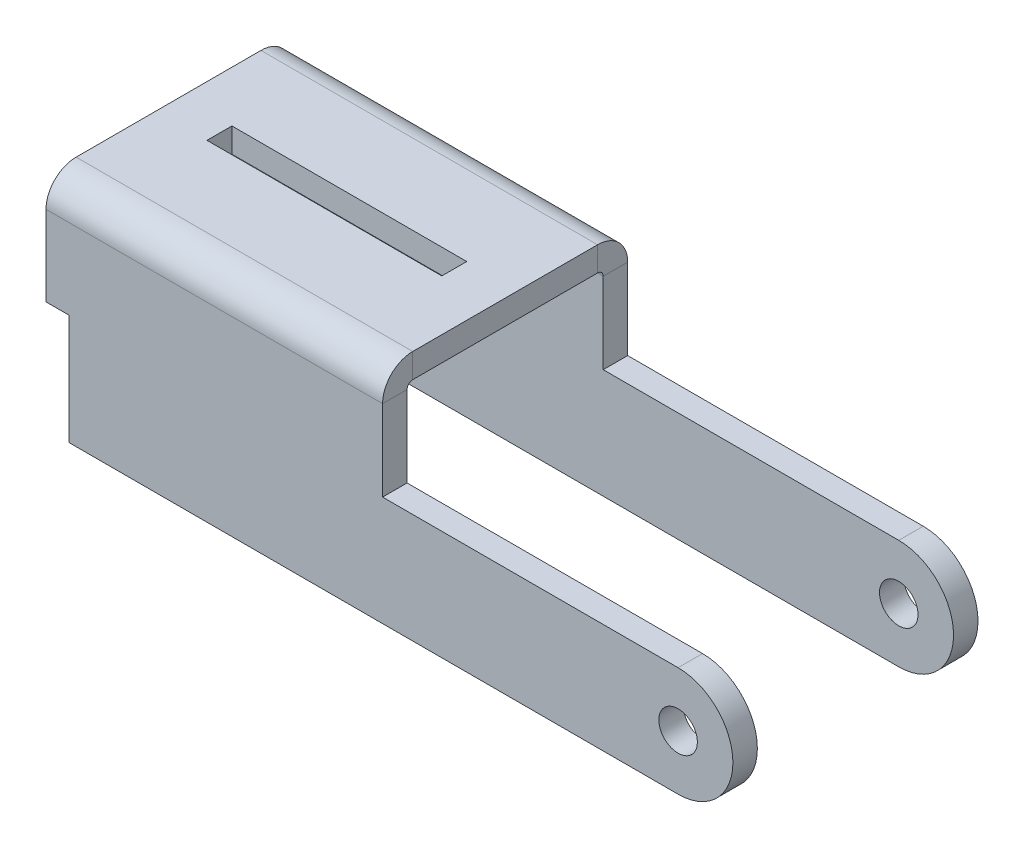
ISO-10303-21;
HEADER;
FILE_DESCRIPTION(('STEP AP214'),'2;1');
FILE_NAME('part.step','',(''),(''),'','','');
FILE_SCHEMA(('AUTOMOTIVE_DESIGN { 1 0 10303 214 1 1 1 1 }'));
ENDSEC;
DATA;
#1=APPLICATION_CONTEXT('core data for automotive mechanical design processes');
#2=APPLICATION_PROTOCOL_DEFINITION('international standard','automotive_design',2000,#1);
#3=PRODUCT_CONTEXT('',#1,'mechanical');
#4=PRODUCT('Part','Part','',(#3));
#5=PRODUCT_RELATED_PRODUCT_CATEGORY('part','',(#4));
#6=PRODUCT_DEFINITION_FORMATION('','',#4);
#7=PRODUCT_DEFINITION_CONTEXT('part definition',#1,'design');
#8=PRODUCT_DEFINITION('design','',#6,#7);
#9=PRODUCT_DEFINITION_SHAPE('','',#8);
#10=(LENGTH_UNIT() NAMED_UNIT(*) SI_UNIT(.MILLI.,.METRE.));
#11=(NAMED_UNIT(*) PLANE_ANGLE_UNIT() SI_UNIT($,.RADIAN.));
#12=(NAMED_UNIT(*) SI_UNIT($,.STERADIAN.) SOLID_ANGLE_UNIT());
#13=UNCERTAINTY_MEASURE_WITH_UNIT(LENGTH_MEASURE(1.E-05),#10,'distance_accuracy_value','');
#14=(GEOMETRIC_REPRESENTATION_CONTEXT(3) GLOBAL_UNCERTAINTY_ASSIGNED_CONTEXT((#13)) GLOBAL_UNIT_ASSIGNED_CONTEXT((#10,
#11,#12)) REPRESENTATION_CONTEXT('',''));
#15=CARTESIAN_POINT('',(0.,0.,0.));
#16=DIRECTION('',(0.,0.,1.));
#17=DIRECTION('',(1.,0.,0.));
#18=AXIS2_PLACEMENT_3D('',#15,#16,#17);
#19=CARTESIAN_POINT('',(82.042,7.112,-3.175));
#20=DIRECTION('',(0.,0.,1.));
#21=DIRECTION('',(1.,0.,0.));
#22=AXIS2_PLACEMENT_3D('',#19,#20,#21);
#23=CYLINDRICAL_SURFACE('',#22,2.49999999999999);
#24=CARTESIAN_POINT('',(82.042,7.112,0.));
#25=DIRECTION('',(0.,0.,-1.));
#26=DIRECTION('',(-1.,0.,0.));
#27=AXIS2_PLACEMENT_3D('',#24,#25,#26);
#28=CIRCLE('',#27,2.49999999999999);
#29=CARTESIAN_POINT('',(79.5420000000001,7.112,0.));
#30=VERTEX_POINT('',#29);
#31=EDGE_CURVE('E306',#30,#30,#28,.F.);
#32=ORIENTED_EDGE('',*,*,#31,.T.);
#33=EDGE_LOOP('',(#32));
#34=FACE_BOUND('',#33,.T.);
#35=CARTESIAN_POINT('',(82.042,7.112,-3.175));
#36=DIRECTION('',(0.,0.,1.));
#37=DIRECTION('',(1.,0.,0.));
#38=AXIS2_PLACEMENT_3D('',#35,#36,#37);
#39=CIRCLE('',#38,2.49999999999999);
#40=CARTESIAN_POINT('',(84.542,7.112,-3.175));
#41=VERTEX_POINT('',#40);
#42=EDGE_CURVE('E430',#41,#41,#39,.T.);
#43=ORIENTED_EDGE('',*,*,#42,.F.);
#44=EDGE_LOOP('',(#43));
#45=FACE_BOUND('',#44,.T.);
#46=ADVANCED_FACE('F47',(#34,#45),#23,.F.);
#47=CARTESIAN_POINT('',(3.,0.,181.863437594031));
#48=DIRECTION('',(1.,0.,0.));
#49=DIRECTION('',(0.,-1.,0.));
#50=AXIS2_PLACEMENT_3D('',#47,#48,#49);
#51=PLANE('',#50);
#52=DIRECTION('',(0.,0.,-1.));
#53=VECTOR('',#52,1.);
#54=CARTESIAN_POINT('',(3.,14.32,181.863437594031));
#55=LINE('',#54,#53);
#56=CARTESIAN_POINT('',(3.,14.32,0.));
#57=VERTEX_POINT('',#56);
#58=CARTESIAN_POINT('',(3.,14.32,-3.17500000000001));
#59=VERTEX_POINT('',#58);
#60=EDGE_CURVE('E304',#57,#59,#55,.T.);
#61=ORIENTED_EDGE('',*,*,#60,.T.);
#62=DIRECTION('',(0.,1.,0.));
#63=VECTOR('',#62,1.);
#64=CARTESIAN_POINT('',(3.,0.,-3.175));
#65=LINE('',#64,#63);
#66=CARTESIAN_POINT('',(3.,0.,-3.17500000000001));
#67=VERTEX_POINT('',#66);
#68=EDGE_CURVE('E111',#67,#59,#65,.T.);
#69=ORIENTED_EDGE('',*,*,#68,.F.);
#70=DIRECTION('',(0.,0.,-1.));
#71=VECTOR('',#70,1.);
#72=CARTESIAN_POINT('',(3.,0.,181.863437594031));
#73=LINE('',#72,#71);
#74=CARTESIAN_POINT('',(3.,0.,0.));
#75=VERTEX_POINT('',#74);
#76=EDGE_CURVE('E298',#75,#67,#73,.T.);
#77=ORIENTED_EDGE('',*,*,#76,.F.);
#78=DIRECTION('',(0.,-1.,0.));
#79=VECTOR('',#78,1.);
#80=CARTESIAN_POINT('',(3.,0.,0.));
#81=LINE('',#80,#79);
#82=EDGE_CURVE('E106',#57,#75,#81,.T.);
#83=ORIENTED_EDGE('',*,*,#82,.F.);
#84=EDGE_LOOP('',(#61,#69,#77,#83));
#85=FACE_BOUND('',#84,.T.);
#86=ADVANCED_FACE('F450',(#85),#51,.F.);
#87=CARTESIAN_POINT('',(43.688,0.,181.863437594031));
#88=DIRECTION('',(0.,-1.,0.));
#89=DIRECTION('',(0.,0.,-1.));
#90=AXIS2_PLACEMENT_3D('',#87,#88,#89);
#91=PLANE('',#90);
#92=DIRECTION('',(-1.,0.,0.));
#93=VECTOR('',#92,1.);
#94=CARTESIAN_POINT('',(43.688,0.,-3.175));
#95=LINE('',#94,#93);
#96=CARTESIAN_POINT('',(82.042,0.,-3.17500000000001));
#97=VERTEX_POINT('',#96);
#98=EDGE_CURVE('E248',#97,#67,#95,.T.);
#99=ORIENTED_EDGE('',*,*,#98,.F.);
#100=DIRECTION('',(0.,0.,-1.));
#101=VECTOR('',#100,1.);
#102=CARTESIAN_POINT('',(82.042,0.,181.863437594031));
#103=LINE('',#102,#101);
#104=CARTESIAN_POINT('',(82.042,0.,0.));
#105=VERTEX_POINT('',#104);
#106=EDGE_CURVE('E294',#105,#97,#103,.T.);
#107=ORIENTED_EDGE('',*,*,#106,.F.);
#108=DIRECTION('',(-1.,0.,0.));
#109=VECTOR('',#108,1.);
#110=CARTESIAN_POINT('',(43.688,0.,0.));
#111=LINE('',#110,#109);
#112=EDGE_CURVE('E301',#105,#75,#111,.T.);
#113=ORIENTED_EDGE('',*,*,#112,.T.);
#114=ORIENTED_EDGE('',*,*,#76,.T.);
#115=EDGE_LOOP('',(#99,#107,#113,#114));
#116=FACE_BOUND('',#115,.T.);
#117=ADVANCED_FACE('F443',(#116),#91,.T.);
#118=CARTESIAN_POINT('',(82.042,7.112,181.863437594031));
#119=DIRECTION('',(0.,0.,-1.));
#120=DIRECTION('',(0.,1.,0.));
#121=AXIS2_PLACEMENT_3D('',#118,#119,#120);
#122=CYLINDRICAL_SURFACE('',#121,7.112);
#123=ORIENTED_EDGE('',*,*,#106,.T.);
#124=CARTESIAN_POINT('',(82.042,7.112,-3.175));
#125=DIRECTION('',(0.,0.,1.));
#126=DIRECTION('',(1.,0.,0.));
#127=AXIS2_PLACEMENT_3D('',#124,#125,#126);
#128=CIRCLE('',#127,7.112);
#129=CARTESIAN_POINT('',(82.042,14.224,-3.17500000000001));
#130=VERTEX_POINT('',#129);
#131=EDGE_CURVE('E291',#97,#130,#128,.T.);
#132=ORIENTED_EDGE('',*,*,#131,.T.);
#133=DIRECTION('',(0.,0.,-1.));
#134=VECTOR('',#133,1.);
#135=CARTESIAN_POINT('',(82.042,14.224,181.863437594031));
#136=LINE('',#135,#134);
#137=CARTESIAN_POINT('',(82.042,14.224,0.));
#138=VERTEX_POINT('',#137);
#139=EDGE_CURVE('E287',#138,#130,#136,.T.);
#140=ORIENTED_EDGE('',*,*,#139,.F.);
#141=CARTESIAN_POINT('',(82.042,7.112,0.));
#142=DIRECTION('',(0.,0.,-1.));
#143=DIRECTION('',(-1.,0.,0.));
#144=AXIS2_PLACEMENT_3D('',#141,#142,#143);
#145=CIRCLE('',#144,7.112);
#146=EDGE_CURVE('E58',#105,#138,#145,.F.);
#147=ORIENTED_EDGE('',*,*,#146,.F.);
#148=EDGE_LOOP('',(#123,#132,#140,#147));
#149=FACE_BOUND('',#148,.T.);
#150=ADVANCED_FACE('F446',(#149),#122,.T.);
#151=CARTESIAN_POINT('',(43.688,14.224,181.863437594031));
#152=DIRECTION('',(0.,-1.,0.));
#153=DIRECTION('',(0.,0.,-1.));
#154=AXIS2_PLACEMENT_3D('',#151,#152,#153);
#155=PLANE('',#154);
#156=ORIENTED_EDGE('',*,*,#139,.T.);
#157=DIRECTION('',(-1.,0.,0.));
#158=VECTOR('',#157,1.);
#159=CARTESIAN_POINT('',(43.688,14.224,-3.175));
#160=LINE('',#159,#158);
#161=CARTESIAN_POINT('',(43.688,14.224,-3.175));
#162=VERTEX_POINT('',#161);
#163=EDGE_CURVE('E284',#130,#162,#160,.T.);
#164=ORIENTED_EDGE('',*,*,#163,.T.);
#165=DIRECTION('',(0.,0.,-1.));
#166=VECTOR('',#165,1.);
#167=CARTESIAN_POINT('',(43.688,14.224,181.863437594031));
#168=LINE('',#167,#166);
#169=CARTESIAN_POINT('',(43.688,14.224,0.));
#170=VERTEX_POINT('',#169);
#171=EDGE_CURVE('E67',#170,#162,#168,.T.);
#172=ORIENTED_EDGE('',*,*,#171,.F.);
#173=DIRECTION('',(-1.,0.,0.));
#174=VECTOR('',#173,1.);
#175=CARTESIAN_POINT('',(43.688,14.224,0.));
#176=LINE('',#175,#174);
#177=EDGE_CURVE('E11',#138,#170,#176,.T.);
#178=ORIENTED_EDGE('',*,*,#177,.F.);
#179=EDGE_LOOP('',(#156,#164,#172,#178));
#180=FACE_BOUND('',#179,.T.);
#181=ADVANCED_FACE('F463',(#180),#155,.F.);
#182=CARTESIAN_POINT('',(43.688,14.32,181.863437594031));
#183=DIRECTION('',(0.,1.,0.));
#184=DIRECTION('',(1.,0.,0.));
#185=AXIS2_PLACEMENT_3D('',#182,#183,#184);
#186=PLANE('',#185);
#187=DIRECTION('',(0.,0.,-1.));
#188=VECTOR('',#187,1.);
#189=CARTESIAN_POINT('',(0.,14.32,181.863437594031));
#190=LINE('',#189,#188);
#191=CARTESIAN_POINT('',(0.,14.32,0.));
#192=VERTEX_POINT('',#191);
#193=CARTESIAN_POINT('',(0.,14.32,-3.17500000000001));
#194=VERTEX_POINT('',#193);
#195=EDGE_CURVE('E272',#192,#194,#190,.T.);
#196=ORIENTED_EDGE('',*,*,#195,.T.);
#197=DIRECTION('',(-1.,0.,0.));
#198=VECTOR('',#197,1.);
#199=CARTESIAN_POINT('',(43.688,14.32,-3.175));
#200=LINE('',#199,#198);
#201=EDGE_CURVE('E277',#59,#194,#200,.T.);
#202=ORIENTED_EDGE('',*,*,#201,.F.);
#203=ORIENTED_EDGE('',*,*,#60,.F.);
#204=DIRECTION('',(1.,0.,0.));
#205=VECTOR('',#204,1.);
#206=CARTESIAN_POINT('',(43.688,14.32,0.));
#207=LINE('',#206,#205);
#208=EDGE_CURVE('E412',#192,#57,#207,.T.);
#209=ORIENTED_EDGE('',*,*,#208,.F.);
#210=EDGE_LOOP('',(#196,#202,#203,#209));
#211=FACE_BOUND('',#210,.T.);
#212=ADVANCED_FACE('F466',(#211),#186,.F.);
#213=CARTESIAN_POINT('',(0.,0.,181.863437594031));
#214=DIRECTION('',(1.,0.,0.));
#215=DIRECTION('',(0.,-1.,0.));
#216=AXIS2_PLACEMENT_3D('',#213,#214,#215);
#217=PLANE('',#216);
#218=DIRECTION('',(0.,0.,-1.));
#219=VECTOR('',#218,1.);
#220=CARTESIAN_POINT('',(0.,24.7259,181.863437594031));
#221=LINE('',#220,#219);
#222=CARTESIAN_POINT('',(0.,24.7259,0.));
#223=VERTEX_POINT('',#222);
#224=CARTESIAN_POINT('',(0.,24.7259,-3.175));
#225=VERTEX_POINT('',#224);
#226=EDGE_CURVE('E256',#223,#225,#221,.T.);
#227=ORIENTED_EDGE('',*,*,#226,.T.);
#228=DIRECTION('',(0.,1.,0.));
#229=VECTOR('',#228,1.);
#230=CARTESIAN_POINT('',(0.,0.,-3.175));
#231=LINE('',#230,#229);
#232=EDGE_CURVE('E249',#194,#225,#231,.T.);
#233=ORIENTED_EDGE('',*,*,#232,.F.);
#234=ORIENTED_EDGE('',*,*,#195,.F.);
#235=DIRECTION('',(0.,-1.,0.));
#236=VECTOR('',#235,1.);
#237=CARTESIAN_POINT('',(0.,0.,0.));
#238=LINE('',#237,#236);
#239=EDGE_CURVE('E269',#223,#192,#238,.T.);
#240=ORIENTED_EDGE('',*,*,#239,.F.);
#241=EDGE_LOOP('',(#227,#233,#234,#240));
#242=FACE_BOUND('',#241,.T.);
#243=ADVANCED_FACE('F265',(#242),#217,.F.);
#244=CARTESIAN_POINT('',(43.688,0.,-3.175));
#245=DIRECTION('',(0.,0.,1.));
#246=DIRECTION('',(1.,0.,0.));
#247=AXIS2_PLACEMENT_3D('',#244,#245,#246);
#248=PLANE('',#247);
#249=ORIENTED_EDGE('',*,*,#232,.T.);
#250=DIRECTION('',(1.,0.,0.));
#251=VECTOR('',#250,1.);
#252=CARTESIAN_POINT('',(0.,24.7259,-3.17500000000001));
#253=LINE('',#252,#251);
#254=CARTESIAN_POINT('',(43.688,24.7259,-3.175));
#255=VERTEX_POINT('',#254);
#256=EDGE_CURVE('E236',#225,#255,#253,.T.);
#257=ORIENTED_EDGE('',*,*,#256,.T.);
#258=DIRECTION('',(0.,1.,0.));
#259=VECTOR('',#258,1.);
#260=CARTESIAN_POINT('',(43.688,0.,-3.175));
#261=LINE('',#260,#259);
#262=EDGE_CURVE('E427',#162,#255,#261,.T.);
#263=ORIENTED_EDGE('',*,*,#262,.F.);
#264=ORIENTED_EDGE('',*,*,#163,.F.);
#265=ORIENTED_EDGE('',*,*,#131,.F.);
#266=ORIENTED_EDGE('',*,*,#98,.T.);
#267=ORIENTED_EDGE('',*,*,#68,.T.);
#268=ORIENTED_EDGE('',*,*,#201,.T.);
#269=EDGE_LOOP('',(#249,#257,#263,#264,#265,#266,#267,#268));
#270=FACE_BOUND('',#269,.T.);
#271=ORIENTED_EDGE('',*,*,#42,.T.);
#272=EDGE_LOOP('',(#271));
#273=FACE_BOUND('',#272,.T.);
#274=ADVANCED_FACE('F275',(#270,#273),#248,.F.);
#275=CARTESIAN_POINT('',(43.688,0.,181.863437594031));
#276=DIRECTION('',(1.,0.,0.));
#277=DIRECTION('',(0.,-1.,0.));
#278=AXIS2_PLACEMENT_3D('',#275,#276,#277);
#279=PLANE('',#278);
#280=ORIENTED_EDGE('',*,*,#262,.T.);
#281=DIRECTION('',(0.,0.,-1.));
#282=VECTOR('',#281,1.);
#283=CARTESIAN_POINT('',(43.688,24.7259,181.863437594031));
#284=LINE('',#283,#282);
#285=CARTESIAN_POINT('',(43.688,24.7259,0.));
#286=VERTEX_POINT('',#285);
#287=EDGE_CURVE('E51',#286,#255,#284,.T.);
#288=ORIENTED_EDGE('',*,*,#287,.F.);
#289=DIRECTION('',(0.,1.,0.));
#290=VECTOR('',#289,1.);
#291=CARTESIAN_POINT('',(43.688,0.,0.));
#292=LINE('',#291,#290);
#293=EDGE_CURVE('E421',#170,#286,#292,.T.);
#294=ORIENTED_EDGE('',*,*,#293,.F.);
#295=ORIENTED_EDGE('',*,*,#171,.T.);
#296=EDGE_LOOP('',(#280,#288,#294,#295));
#297=FACE_BOUND('',#296,.T.);
#298=ADVANCED_FACE('F474',(#297),#279,.T.);
#299=CARTESIAN_POINT('',(43.688,0.,0.));
#300=DIRECTION('',(0.,0.,-1.));
#301=DIRECTION('',(-1.,0.,0.));
#302=AXIS2_PLACEMENT_3D('',#299,#300,#301);
#303=PLANE('',#302);
#304=ORIENTED_EDGE('',*,*,#293,.T.);
#305=DIRECTION('',(-1.,0.,0.));
#306=VECTOR('',#305,1.);
#307=CARTESIAN_POINT('',(0.,24.7259,0.));
#308=LINE('',#307,#306);
#309=EDGE_CURVE('E418',#286,#223,#308,.T.);
#310=ORIENTED_EDGE('',*,*,#309,.T.);
#311=ORIENTED_EDGE('',*,*,#239,.T.);
#312=ORIENTED_EDGE('',*,*,#208,.T.);
#313=ORIENTED_EDGE('',*,*,#82,.T.);
#314=ORIENTED_EDGE('',*,*,#112,.F.);
#315=ORIENTED_EDGE('',*,*,#146,.T.);
#316=ORIENTED_EDGE('',*,*,#177,.T.);
#317=EDGE_LOOP('',(#304,#310,#311,#312,#313,#314,#315,#316));
#318=FACE_BOUND('',#317,.T.);
#319=ORIENTED_EDGE('',*,*,#31,.F.);
#320=EDGE_LOOP('',(#319));
#321=FACE_BOUND('',#320,.T.);
#322=ADVANCED_FACE('F49',(#318,#321),#303,.F.);
#323=CARTESIAN_POINT('',(82.042,7.112,-3.175));
#324=DIRECTION('',(0.,0.,1.));
#325=DIRECTION('',(1.,0.,0.));
#326=AXIS2_PLACEMENT_3D('',#323,#324,#325);
#327=CYLINDRICAL_SURFACE('',#326,2.49999999999999);
#328=CARTESIAN_POINT('',(82.042,7.112,25.4625));
#329=DIRECTION('',(0.,0.,1.));
#330=DIRECTION('',(1.,0.,0.));
#331=AXIS2_PLACEMENT_3D('',#328,#329,#330);
#332=CIRCLE('',#331,2.49999999999999);
#333=CARTESIAN_POINT('',(84.542,7.112,25.4625));
#334=VERTEX_POINT('',#333);
#335=EDGE_CURVE('E399',#334,#334,#332,.F.);
#336=ORIENTED_EDGE('',*,*,#335,.T.);
#337=EDGE_LOOP('',(#336));
#338=FACE_BOUND('',#337,.T.);
#339=CARTESIAN_POINT('',(82.042,7.112,28.6375));
#340=DIRECTION('',(0.,0.,1.));
#341=DIRECTION('',(1.,0.,0.));
#342=AXIS2_PLACEMENT_3D('',#339,#340,#341);
#343=CIRCLE('',#342,2.49999999999999);
#344=CARTESIAN_POINT('',(84.542,7.112,28.6375));
#345=VERTEX_POINT('',#344);
#346=EDGE_CURVE('E395',#345,#345,#343,.T.);
#347=ORIENTED_EDGE('',*,*,#346,.T.);
#348=EDGE_LOOP('',(#347));
#349=FACE_BOUND('',#348,.T.);
#350=ADVANCED_FACE('F479',(#338,#349),#327,.F.);
#351=CARTESIAN_POINT('',(82.042,7.112,-156.400937594031));
#352=DIRECTION('',(0.,0.,1.));
#353=DIRECTION('',(0.,-1.,0.));
#354=AXIS2_PLACEMENT_3D('',#351,#352,#353);
#355=CYLINDRICAL_SURFACE('',#354,7.112);
#356=DIRECTION('',(0.,0.,1.));
#357=VECTOR('',#356,1.);
#358=CARTESIAN_POINT('',(82.042,14.224,-156.400937594031));
#359=LINE('',#358,#357);
#360=CARTESIAN_POINT('',(82.042,14.224,25.4625));
#361=VERTEX_POINT('',#360);
#362=CARTESIAN_POINT('',(82.042,14.224,28.6375));
#363=VERTEX_POINT('',#362);
#364=EDGE_CURVE('E391',#361,#363,#359,.T.);
#365=ORIENTED_EDGE('',*,*,#364,.T.);
#366=CARTESIAN_POINT('',(82.042,7.112,28.6375));
#367=DIRECTION('',(0.,0.,1.));
#368=DIRECTION('',(1.,0.,0.));
#369=AXIS2_PLACEMENT_3D('',#366,#367,#368);
#370=CIRCLE('',#369,7.112);
#371=CARTESIAN_POINT('',(82.042,0.,28.6375));
#372=VERTEX_POINT('',#371);
#373=EDGE_CURVE('E348',#372,#363,#370,.T.);
#374=ORIENTED_EDGE('',*,*,#373,.F.);
#375=DIRECTION('',(0.,0.,1.));
#376=VECTOR('',#375,1.);
#377=CARTESIAN_POINT('',(82.042,0.,-156.400937594031));
#378=LINE('',#377,#376);
#379=CARTESIAN_POINT('',(82.042,0.,25.4625));
#380=VERTEX_POINT('',#379);
#381=EDGE_CURVE('E387',#380,#372,#378,.T.);
#382=ORIENTED_EDGE('',*,*,#381,.F.);
#383=CARTESIAN_POINT('',(82.042,7.112,25.4625));
#384=DIRECTION('',(0.,0.,1.));
#385=DIRECTION('',(1.,0.,0.));
#386=AXIS2_PLACEMENT_3D('',#383,#384,#385);
#387=CIRCLE('',#386,7.112);
#388=EDGE_CURVE('E326',#361,#380,#387,.F.);
#389=ORIENTED_EDGE('',*,*,#388,.F.);
#390=EDGE_LOOP('',(#365,#374,#382,#389));
#391=FACE_BOUND('',#390,.T.);
#392=ADVANCED_FACE('F609',(#391),#355,.T.);
#393=CARTESIAN_POINT('',(43.688,0.,-156.400937594031));
#394=DIRECTION('',(0.,1.,0.));
#395=DIRECTION('',(0.,0.,1.));
#396=AXIS2_PLACEMENT_3D('',#393,#394,#395);
#397=PLANE('',#396);
#398=ORIENTED_EDGE('',*,*,#381,.T.);
#399=DIRECTION('',(-1.,0.,0.));
#400=VECTOR('',#399,1.);
#401=CARTESIAN_POINT('',(43.688,0.,28.6375));
#402=LINE('',#401,#400);
#403=CARTESIAN_POINT('',(3.,0.,28.6375));
#404=VERTEX_POINT('',#403);
#405=EDGE_CURVE('E383',#372,#404,#402,.T.);
#406=ORIENTED_EDGE('',*,*,#405,.T.);
#407=DIRECTION('',(0.,0.,1.));
#408=VECTOR('',#407,1.);
#409=CARTESIAN_POINT('',(3.,0.,-156.400937594031));
#410=LINE('',#409,#408);
#411=CARTESIAN_POINT('',(3.,0.,25.4625));
#412=VERTEX_POINT('',#411);
#413=EDGE_CURVE('E379',#412,#404,#410,.T.);
#414=ORIENTED_EDGE('',*,*,#413,.F.);
#415=DIRECTION('',(-1.,0.,0.));
#416=VECTOR('',#415,1.);
#417=CARTESIAN_POINT('',(43.688,0.,25.4625));
#418=LINE('',#417,#416);
#419=EDGE_CURVE('E319',#380,#412,#418,.T.);
#420=ORIENTED_EDGE('',*,*,#419,.F.);
#421=EDGE_LOOP('',(#398,#406,#414,#420));
#422=FACE_BOUND('',#421,.T.);
#423=ADVANCED_FACE('F615',(#422),#397,.F.);
#424=CARTESIAN_POINT('',(3.,0.,-156.400937594031));
#425=DIRECTION('',(1.,0.,0.));
#426=DIRECTION('',(0.,1.,0.));
#427=AXIS2_PLACEMENT_3D('',#424,#425,#426);
#428=PLANE('',#427);
#429=ORIENTED_EDGE('',*,*,#413,.T.);
#430=DIRECTION('',(0.,1.,0.));
#431=VECTOR('',#430,1.);
#432=CARTESIAN_POINT('',(3.,14.32,28.6375));
#433=LINE('',#432,#431);
#434=CARTESIAN_POINT('',(3.,14.32,28.6375));
#435=VERTEX_POINT('',#434);
#436=EDGE_CURVE('E376',#404,#435,#433,.T.);
#437=ORIENTED_EDGE('',*,*,#436,.T.);
#438=DIRECTION('',(0.,0.,1.));
#439=VECTOR('',#438,1.);
#440=CARTESIAN_POINT('',(3.,14.32,-156.400937594031));
#441=LINE('',#440,#439);
#442=CARTESIAN_POINT('',(3.,14.32,25.4625));
#443=VERTEX_POINT('',#442);
#444=EDGE_CURVE('E372',#443,#435,#441,.T.);
#445=ORIENTED_EDGE('',*,*,#444,.F.);
#446=DIRECTION('',(0.,1.,0.));
#447=VECTOR('',#446,1.);
#448=CARTESIAN_POINT('',(3.,0.,25.4625));
#449=LINE('',#448,#447);
#450=EDGE_CURVE('E316',#412,#443,#449,.T.);
#451=ORIENTED_EDGE('',*,*,#450,.F.);
#452=EDGE_LOOP('',(#429,#437,#445,#451));
#453=FACE_BOUND('',#452,.T.);
#454=ADVANCED_FACE('F617',(#453),#428,.F.);
#455=CARTESIAN_POINT('',(43.688,14.32,-156.400937594031));
#456=DIRECTION('',(0.,1.,0.));
#457=DIRECTION('',(-1.,0.,0.));
#458=AXIS2_PLACEMENT_3D('',#455,#456,#457);
#459=PLANE('',#458);
#460=ORIENTED_EDGE('',*,*,#444,.T.);
#461=DIRECTION('',(-1.,0.,0.));
#462=VECTOR('',#461,1.);
#463=CARTESIAN_POINT('',(0.,14.32,28.6375));
#464=LINE('',#463,#462);
#465=CARTESIAN_POINT('',(0.,14.32,28.6375));
#466=VERTEX_POINT('',#465);
#467=EDGE_CURVE('E158',#435,#466,#464,.T.);
#468=ORIENTED_EDGE('',*,*,#467,.T.);
#469=DIRECTION('',(0.,0.,1.));
#470=VECTOR('',#469,1.);
#471=CARTESIAN_POINT('',(0.,14.32,-156.400937594031));
#472=LINE('',#471,#470);
#473=CARTESIAN_POINT('',(0.,14.32,25.4624999999999));
#474=VERTEX_POINT('',#473);
#475=EDGE_CURVE('E341',#474,#466,#472,.T.);
#476=ORIENTED_EDGE('',*,*,#475,.F.);
#477=DIRECTION('',(-1.,0.,0.));
#478=VECTOR('',#477,1.);
#479=CARTESIAN_POINT('',(43.688,14.32,25.4625));
#480=LINE('',#479,#478);
#481=EDGE_CURVE('E120',#443,#474,#480,.T.);
#482=ORIENTED_EDGE('',*,*,#481,.F.);
#483=EDGE_LOOP('',(#460,#468,#476,#482));
#484=FACE_BOUND('',#483,.T.);
#485=ADVANCED_FACE('F621',(#484),#459,.F.);
#486=CARTESIAN_POINT('',(43.688,14.224,-156.400937594031));
#487=DIRECTION('',(0.,-1.,0.));
#488=DIRECTION('',(0.,0.,-1.));
#489=AXIS2_PLACEMENT_3D('',#486,#487,#488);
#490=PLANE('',#489);
#491=DIRECTION('',(0.,0.,1.));
#492=VECTOR('',#491,1.);
#493=CARTESIAN_POINT('',(43.688,14.224,-156.400937594031));
#494=LINE('',#493,#492);
#495=CARTESIAN_POINT('',(43.688,14.224,25.4625));
#496=VERTEX_POINT('',#495);
#497=CARTESIAN_POINT('',(43.688,14.224,28.6375));
#498=VERTEX_POINT('',#497);
#499=EDGE_CURVE('E366',#496,#498,#494,.T.);
#500=ORIENTED_EDGE('',*,*,#499,.T.);
#501=DIRECTION('',(-1.,0.,0.));
#502=VECTOR('',#501,1.);
#503=CARTESIAN_POINT('',(43.688,14.224,28.6375));
#504=LINE('',#503,#502);
#505=EDGE_CURVE('E345',#363,#498,#504,.T.);
#506=ORIENTED_EDGE('',*,*,#505,.F.);
#507=ORIENTED_EDGE('',*,*,#364,.F.);
#508=DIRECTION('',(1.,0.,0.));
#509=VECTOR('',#508,1.);
#510=CARTESIAN_POINT('',(43.688,14.224,25.4625));
#511=LINE('',#510,#509);
#512=EDGE_CURVE('E329',#496,#361,#511,.T.);
#513=ORIENTED_EDGE('',*,*,#512,.F.);
#514=EDGE_LOOP('',(#500,#506,#507,#513));
#515=FACE_BOUND('',#514,.T.);
#516=ADVANCED_FACE('F606',(#515),#490,.F.);
#517=CARTESIAN_POINT('',(43.688,0.,-156.400937594031));
#518=DIRECTION('',(1.,0.,0.));
#519=DIRECTION('',(0.,1.,0.));
#520=AXIS2_PLACEMENT_3D('',#517,#518,#519);
#521=PLANE('',#520);
#522=DIRECTION('',(0.,-1.,0.));
#523=VECTOR('',#522,1.);
#524=CARTESIAN_POINT('',(43.688,0.,28.6375));
#525=LINE('',#524,#523);
#526=CARTESIAN_POINT('',(43.688,24.7259,28.6375));
#527=VERTEX_POINT('',#526);
#528=EDGE_CURVE('E362',#527,#498,#525,.T.);
#529=ORIENTED_EDGE('',*,*,#528,.T.);
#530=ORIENTED_EDGE('',*,*,#499,.F.);
#531=DIRECTION('',(0.,1.,0.));
#532=VECTOR('',#531,1.);
#533=CARTESIAN_POINT('',(43.688,0.,25.4625));
#534=LINE('',#533,#532);
#535=CARTESIAN_POINT('',(43.688,24.7259,25.4625));
#536=VERTEX_POINT('',#535);
#537=EDGE_CURVE('E358',#496,#536,#534,.T.);
#538=ORIENTED_EDGE('',*,*,#537,.T.);
#539=DIRECTION('',(0.,0.,1.));
#540=VECTOR('',#539,1.);
#541=CARTESIAN_POINT('',(43.688,24.7259,-156.400937594031));
#542=LINE('',#541,#540);
#543=EDGE_CURVE('E354',#536,#527,#542,.T.);
#544=ORIENTED_EDGE('',*,*,#543,.T.);
#545=EDGE_LOOP('',(#529,#530,#538,#544));
#546=FACE_BOUND('',#545,.T.);
#547=ADVANCED_FACE('F599',(#546),#521,.T.);
#548=CARTESIAN_POINT('',(43.688,0.,28.6375));
#549=DIRECTION('',(0.,0.,-1.));
#550=DIRECTION('',(-1.,0.,0.));
#551=AXIS2_PLACEMENT_3D('',#548,#549,#550);
#552=PLANE('',#551);
#553=ORIENTED_EDGE('',*,*,#528,.F.);
#554=DIRECTION('',(-1.,0.,0.));
#555=VECTOR('',#554,1.);
#556=CARTESIAN_POINT('',(43.688,24.7259,28.6375));
#557=LINE('',#556,#555);
#558=CARTESIAN_POINT('',(0.,24.7259,28.6375));
#559=VERTEX_POINT('',#558);
#560=EDGE_CURVE('E351',#527,#559,#557,.T.);
#561=ORIENTED_EDGE('',*,*,#560,.T.);
#562=DIRECTION('',(0.,1.,0.));
#563=VECTOR('',#562,1.);
#564=CARTESIAN_POINT('',(0.,0.,28.6375));
#565=LINE('',#564,#563);
#566=EDGE_CURVE('E162',#466,#559,#565,.T.);
#567=ORIENTED_EDGE('',*,*,#566,.F.);
#568=ORIENTED_EDGE('',*,*,#467,.F.);
#569=ORIENTED_EDGE('',*,*,#436,.F.);
#570=ORIENTED_EDGE('',*,*,#405,.F.);
#571=ORIENTED_EDGE('',*,*,#373,.T.);
#572=ORIENTED_EDGE('',*,*,#505,.T.);
#573=EDGE_LOOP('',(#553,#561,#567,#568,#569,#570,#571,#572));
#574=FACE_BOUND('',#573,.T.);
#575=ORIENTED_EDGE('',*,*,#346,.F.);
#576=EDGE_LOOP('',(#575));
#577=FACE_BOUND('',#576,.T.);
#578=ADVANCED_FACE('F594',(#574,#577),#552,.F.);
#579=CARTESIAN_POINT('',(0.,0.,-156.400937594031));
#580=DIRECTION('',(1.,0.,0.));
#581=DIRECTION('',(0.,1.,0.));
#582=AXIS2_PLACEMENT_3D('',#579,#580,#581);
#583=PLANE('',#582);
#584=ORIENTED_EDGE('',*,*,#475,.T.);
#585=ORIENTED_EDGE('',*,*,#566,.T.);
#586=DIRECTION('',(0.,0.,1.));
#587=VECTOR('',#586,1.);
#588=CARTESIAN_POINT('',(0.,24.7259,-156.400937594031));
#589=LINE('',#588,#587);
#590=CARTESIAN_POINT('',(0.,24.7259,25.4625));
#591=VERTEX_POINT('',#590);
#592=EDGE_CURVE('E403',#591,#559,#589,.T.);
#593=ORIENTED_EDGE('',*,*,#592,.F.);
#594=DIRECTION('',(0.,1.,0.));
#595=VECTOR('',#594,1.);
#596=CARTESIAN_POINT('',(0.,0.,25.4625));
#597=LINE('',#596,#595);
#598=EDGE_CURVE('E336',#474,#591,#597,.T.);
#599=ORIENTED_EDGE('',*,*,#598,.F.);
#600=EDGE_LOOP('',(#584,#585,#593,#599));
#601=FACE_BOUND('',#600,.T.);
#602=ADVANCED_FACE('F623',(#601),#583,.F.);
#603=CARTESIAN_POINT('',(43.688,0.,25.4625));
#604=DIRECTION('',(0.,0.,1.));
#605=DIRECTION('',(1.,0.,0.));
#606=AXIS2_PLACEMENT_3D('',#603,#604,#605);
#607=PLANE('',#606);
#608=ORIENTED_EDGE('',*,*,#598,.T.);
#609=DIRECTION('',(1.,0.,0.));
#610=VECTOR('',#609,1.);
#611=CARTESIAN_POINT('',(43.688,24.7259,25.4625));
#612=LINE('',#611,#610);
#613=EDGE_CURVE('E332',#591,#536,#612,.T.);
#614=ORIENTED_EDGE('',*,*,#613,.T.);
#615=ORIENTED_EDGE('',*,*,#537,.F.);
#616=ORIENTED_EDGE('',*,*,#512,.T.);
#617=ORIENTED_EDGE('',*,*,#388,.T.);
#618=ORIENTED_EDGE('',*,*,#419,.T.);
#619=ORIENTED_EDGE('',*,*,#450,.T.);
#620=ORIENTED_EDGE('',*,*,#481,.T.);
#621=EDGE_LOOP('',(#608,#614,#615,#616,#617,#618,#619,#620));
#622=FACE_BOUND('',#621,.T.);
#623=ORIENTED_EDGE('',*,*,#335,.F.);
#624=EDGE_LOOP('',(#623));
#625=FACE_BOUND('',#624,.T.);
#626=ADVANCED_FACE('F601',(#622,#625),#607,.F.);
#627=CARTESIAN_POINT('',(43.688,28.6375,-3.175));
#628=DIRECTION('',(0.,-1.,0.));
#629=DIRECTION('',(0.,0.,-1.));
#630=AXIS2_PLACEMENT_3D('',#627,#628,#629);
#631=PLANE('',#630);
#632=DIRECTION('',(1.,0.,0.));
#633=VECTOR('',#632,1.);
#634=CARTESIAN_POINT('',(37.084,28.6375,14.35));
#635=LINE('',#634,#633);
#636=CARTESIAN_POINT('',(6.60400000000001,28.6375,14.35));
#637=VERTEX_POINT('',#636);
#638=CARTESIAN_POINT('',(37.084,28.6375,14.35));
#639=VERTEX_POINT('',#638);
#640=EDGE_CURVE('E550',#637,#639,#635,.T.);
#641=ORIENTED_EDGE('',*,*,#640,.F.);
#642=DIRECTION('',(0.,0.,1.));
#643=VECTOR('',#642,1.);
#644=CARTESIAN_POINT('',(6.604,28.6375,14.35));
#645=LINE('',#644,#643);
#646=CARTESIAN_POINT('',(6.604,28.6375,11.1125));
#647=VERTEX_POINT('',#646);
#648=EDGE_CURVE('E554',#647,#637,#645,.T.);
#649=ORIENTED_EDGE('',*,*,#648,.F.);
#650=DIRECTION('',(-1.,0.,0.));
#651=VECTOR('',#650,1.);
#652=CARTESIAN_POINT('',(37.084,28.6375,11.1125));
#653=LINE('',#652,#651);
#654=CARTESIAN_POINT('',(37.084,28.6375,11.1125));
#655=VERTEX_POINT('',#654);
#656=EDGE_CURVE('E533',#655,#647,#653,.T.);
#657=ORIENTED_EDGE('',*,*,#656,.F.);
#658=DIRECTION('',(0.,0.,-1.));
#659=VECTOR('',#658,1.);
#660=CARTESIAN_POINT('',(37.084,28.6375,14.35));
#661=LINE('',#660,#659);
#662=EDGE_CURVE('E543',#639,#655,#661,.T.);
#663=ORIENTED_EDGE('',*,*,#662,.F.);
#664=EDGE_LOOP('',(#641,#649,#657,#663));
#665=FACE_BOUND('',#664,.T.);
#666=DIRECTION('',(1.,0.,0.));
#667=VECTOR('',#666,1.);
#668=CARTESIAN_POINT('',(0.,28.6375,0.736600000000001));
#669=LINE('',#668,#667);
#670=CARTESIAN_POINT('',(0.,28.6375,0.736600000000001));
#671=VERTEX_POINT('',#670);
#672=CARTESIAN_POINT('',(43.688,28.6375,0.736599999999987));
#673=VERTEX_POINT('',#672);
#674=EDGE_CURVE('E566',#671,#673,#669,.T.);
#675=ORIENTED_EDGE('',*,*,#674,.F.);
#676=DIRECTION('',(0.,0.,1.));
#677=VECTOR('',#676,1.);
#678=CARTESIAN_POINT('',(0.,28.6375,-3.175));
#679=LINE('',#678,#677);
#680=CARTESIAN_POINT('',(0.,28.6375,24.7259));
#681=VERTEX_POINT('',#680);
#682=EDGE_CURVE('E169',#671,#681,#679,.T.);
#683=ORIENTED_EDGE('',*,*,#682,.T.);
#684=DIRECTION('',(-1.,0.,0.));
#685=VECTOR('',#684,1.);
#686=CARTESIAN_POINT('',(43.688,28.6375,24.7259));
#687=LINE('',#686,#685);
#688=CARTESIAN_POINT('',(43.688,28.6375,24.7259));
#689=VERTEX_POINT('',#688);
#690=EDGE_CURVE('E174',#689,#681,#687,.T.);
#691=ORIENTED_EDGE('',*,*,#690,.F.);
#692=DIRECTION('',(0.,0.,1.));
#693=VECTOR('',#692,1.);
#694=CARTESIAN_POINT('',(43.688,28.6375,-3.175));
#695=LINE('',#694,#693);
#696=EDGE_CURVE('E560',#673,#689,#695,.T.);
#697=ORIENTED_EDGE('',*,*,#696,.F.);
#698=EDGE_LOOP('',(#675,#683,#691,#697));
#699=FACE_BOUND('',#698,.T.);
#700=ADVANCED_FACE('F648',(#665,#699),#631,.F.);
#701=CARTESIAN_POINT('',(43.688,25.4625,0.));
#702=DIRECTION('',(0.,1.,0.));
#703=DIRECTION('',(0.,0.,1.));
#704=AXIS2_PLACEMENT_3D('',#701,#702,#703);
#705=PLANE('',#704);
#706=DIRECTION('',(-1.,0.,0.));
#707=VECTOR('',#706,1.);
#708=CARTESIAN_POINT('',(43.688,25.4625,11.1125));
#709=LINE('',#708,#707);
#710=CARTESIAN_POINT('',(37.084,25.4625,11.1125));
#711=VERTEX_POINT('',#710);
#712=CARTESIAN_POINT('',(6.604,25.4625,11.1125));
#713=VERTEX_POINT('',#712);
#714=EDGE_CURVE('E503',#711,#713,#709,.T.);
#715=ORIENTED_EDGE('',*,*,#714,.T.);
#716=DIRECTION('',(0.,0.,1.));
#717=VECTOR('',#716,1.);
#718=CARTESIAN_POINT('',(6.604,25.4625,0.));
#719=LINE('',#718,#717);
#720=CARTESIAN_POINT('',(6.604,25.4625,14.35));
#721=VERTEX_POINT('',#720);
#722=EDGE_CURVE('E513',#713,#721,#719,.T.);
#723=ORIENTED_EDGE('',*,*,#722,.T.);
#724=DIRECTION('',(1.,0.,0.));
#725=VECTOR('',#724,1.);
#726=CARTESIAN_POINT('',(43.688,25.4625,14.35));
#727=LINE('',#726,#725);
#728=CARTESIAN_POINT('',(37.084,25.4625,14.35));
#729=VERTEX_POINT('',#728);
#730=EDGE_CURVE('E516',#721,#729,#727,.T.);
#731=ORIENTED_EDGE('',*,*,#730,.T.);
#732=DIRECTION('',(0.,0.,-1.));
#733=VECTOR('',#732,1.);
#734=CARTESIAN_POINT('',(37.084,25.4625,0.));
#735=LINE('',#734,#733);
#736=EDGE_CURVE('E519',#729,#711,#735,.T.);
#737=ORIENTED_EDGE('',*,*,#736,.T.);
#738=EDGE_LOOP('',(#715,#723,#731,#737));
#739=FACE_BOUND('',#738,.T.);
#740=DIRECTION('',(-1.,0.,0.));
#741=VECTOR('',#740,1.);
#742=CARTESIAN_POINT('',(0.,25.4625,0.736600000000001));
#743=LINE('',#742,#741);
#744=CARTESIAN_POINT('',(43.688,25.4625,0.736599999999988));
#745=VERTEX_POINT('',#744);
#746=CARTESIAN_POINT('',(0.,25.4625,0.736600000000001));
#747=VERTEX_POINT('',#746);
#748=EDGE_CURVE('E563',#745,#747,#743,.T.);
#749=ORIENTED_EDGE('',*,*,#748,.F.);
#750=DIRECTION('',(0.,0.,-1.));
#751=VECTOR('',#750,1.);
#752=CARTESIAN_POINT('',(43.688,25.4625,0.));
#753=LINE('',#752,#751);
#754=CARTESIAN_POINT('',(43.688,25.4625,24.7259));
#755=VERTEX_POINT('',#754);
#756=EDGE_CURVE('E526',#755,#745,#753,.T.);
#757=ORIENTED_EDGE('',*,*,#756,.F.);
#758=DIRECTION('',(1.,0.,0.));
#759=VECTOR('',#758,1.);
#760=CARTESIAN_POINT('',(43.688,25.4625,24.7259));
#761=LINE('',#760,#759);
#762=CARTESIAN_POINT('',(0.,25.4625,24.7259));
#763=VERTEX_POINT('',#762);
#764=EDGE_CURVE('E579',#763,#755,#761,.T.);
#765=ORIENTED_EDGE('',*,*,#764,.F.);
#766=DIRECTION('',(0.,0.,-1.));
#767=VECTOR('',#766,1.);
#768=CARTESIAN_POINT('',(0.,25.4625,0.));
#769=LINE('',#768,#767);
#770=EDGE_CURVE('E523',#763,#747,#769,.T.);
#771=ORIENTED_EDGE('',*,*,#770,.T.);
#772=EDGE_LOOP('',(#749,#757,#765,#771));
#773=FACE_BOUND('',#772,.T.);
#774=ADVANCED_FACE('F644',(#739,#773),#705,.F.);
#775=CARTESIAN_POINT('',(6.604,-15.0505,14.35));
#776=DIRECTION('',(-1.,0.,0.));
#777=DIRECTION('',(0.,0.,1.));
#778=AXIS2_PLACEMENT_3D('',#775,#776,#777);
#779=PLANE('',#778);
#780=DIRECTION('',(0.,1.,0.));
#781=VECTOR('',#780,1.);
#782=CARTESIAN_POINT('',(6.604,-15.0505,11.1125));
#783=LINE('',#782,#781);
#784=EDGE_CURVE('E536',#713,#647,#783,.T.);
#785=ORIENTED_EDGE('',*,*,#784,.T.);
#786=ORIENTED_EDGE('',*,*,#648,.T.);
#787=DIRECTION('',(0.,1.,0.));
#788=VECTOR('',#787,1.);
#789=CARTESIAN_POINT('',(6.604,-15.0505,14.35));
#790=LINE('',#789,#788);
#791=EDGE_CURVE('E547',#721,#637,#790,.T.);
#792=ORIENTED_EDGE('',*,*,#791,.F.);
#793=ORIENTED_EDGE('',*,*,#722,.F.);
#794=EDGE_LOOP('',(#785,#786,#792,#793));
#795=FACE_BOUND('',#794,.T.);
#796=ADVANCED_FACE('F647',(#795),#779,.F.);
#797=CARTESIAN_POINT('',(37.084,-15.0505,14.35));
#798=DIRECTION('',(0.,0.,1.));
#799=DIRECTION('',(1.,0.,0.));
#800=AXIS2_PLACEMENT_3D('',#797,#798,#799);
#801=PLANE('',#800);
#802=ORIENTED_EDGE('',*,*,#791,.T.);
#803=ORIENTED_EDGE('',*,*,#640,.T.);
#804=DIRECTION('',(0.,1.,0.));
#805=VECTOR('',#804,1.);
#806=CARTESIAN_POINT('',(37.084,-15.0505,14.35));
#807=LINE('',#806,#805);
#808=EDGE_CURVE('E540',#729,#639,#807,.T.);
#809=ORIENTED_EDGE('',*,*,#808,.F.);
#810=ORIENTED_EDGE('',*,*,#730,.F.);
#811=EDGE_LOOP('',(#802,#803,#809,#810));
#812=FACE_BOUND('',#811,.T.);
#813=ADVANCED_FACE('F658',(#812),#801,.F.);
#814=CARTESIAN_POINT('',(37.084,-15.0505,14.35));
#815=DIRECTION('',(1.,0.,0.));
#816=DIRECTION('',(0.,0.,-1.));
#817=AXIS2_PLACEMENT_3D('',#814,#815,#816);
#818=PLANE('',#817);
#819=ORIENTED_EDGE('',*,*,#808,.T.);
#820=ORIENTED_EDGE('',*,*,#662,.T.);
#821=DIRECTION('',(0.,1.,0.));
#822=VECTOR('',#821,1.);
#823=CARTESIAN_POINT('',(37.084,-15.0505,11.1125));
#824=LINE('',#823,#822);
#825=EDGE_CURVE('E530',#711,#655,#824,.T.);
#826=ORIENTED_EDGE('',*,*,#825,.F.);
#827=ORIENTED_EDGE('',*,*,#736,.F.);
#828=EDGE_LOOP('',(#819,#820,#826,#827));
#829=FACE_BOUND('',#828,.T.);
#830=ADVANCED_FACE('F654',(#829),#818,.F.);
#831=CARTESIAN_POINT('',(37.084,-15.0505,11.1125));
#832=DIRECTION('',(0.,0.,-1.));
#833=DIRECTION('',(-1.,0.,0.));
#834=AXIS2_PLACEMENT_3D('',#831,#832,#833);
#835=PLANE('',#834);
#836=ORIENTED_EDGE('',*,*,#825,.T.);
#837=ORIENTED_EDGE('',*,*,#656,.T.);
#838=ORIENTED_EDGE('',*,*,#784,.F.);
#839=ORIENTED_EDGE('',*,*,#714,.F.);
#840=EDGE_LOOP('',(#836,#837,#838,#839));
#841=FACE_BOUND('',#840,.T.);
#842=ADVANCED_FACE('F650',(#841),#835,.F.);
#843=CARTESIAN_POINT('',(0.,-71.0445517142379,0.));
#844=DIRECTION('',(1.,0.,0.));
#845=DIRECTION('',(0.,0.,-1.));
#846=AXIS2_PLACEMENT_3D('',#843,#844,#845);
#847=PLANE('',#846);
#848=DIRECTION('',(0.,1.,0.));
#849=VECTOR('',#848,1.);
#850=CARTESIAN_POINT('',(0.,-71.0445517142379,24.7259));
#851=LINE('',#850,#849);
#852=EDGE_CURVE('E569',#763,#681,#851,.T.);
#853=ORIENTED_EDGE('',*,*,#852,.T.);
#854=ORIENTED_EDGE('',*,*,#682,.F.);
#855=DIRECTION('',(0.,1.,0.));
#856=VECTOR('',#855,1.);
#857=CARTESIAN_POINT('',(0.,-71.0445517142379,0.736599999999988));
#858=LINE('',#857,#856);
#859=EDGE_CURVE('E259',#747,#671,#858,.T.);
#860=ORIENTED_EDGE('',*,*,#859,.F.);
#861=ORIENTED_EDGE('',*,*,#770,.F.);
#862=EDGE_LOOP('',(#853,#854,#860,#861));
#863=FACE_BOUND('',#862,.T.);
#864=ADVANCED_FACE('F653',(#863),#847,.F.);
#865=CARTESIAN_POINT('',(43.688,-71.0445517142379,0.));
#866=DIRECTION('',(1.,0.,0.));
#867=DIRECTION('',(0.,0.,-1.));
#868=AXIS2_PLACEMENT_3D('',#865,#866,#867);
#869=PLANE('',#868);
#870=ORIENTED_EDGE('',*,*,#696,.T.);
#871=DIRECTION('',(0.,1.,0.));
#872=VECTOR('',#871,1.);
#873=CARTESIAN_POINT('',(43.688,-71.0445517142379,24.7259));
#874=LINE('',#873,#872);
#875=EDGE_CURVE('E572',#755,#689,#874,.T.);
#876=ORIENTED_EDGE('',*,*,#875,.F.);
#877=ORIENTED_EDGE('',*,*,#756,.T.);
#878=DIRECTION('',(0.,1.,0.));
#879=VECTOR('',#878,1.);
#880=CARTESIAN_POINT('',(43.688,-71.0445517142379,0.736599999999988));
#881=LINE('',#880,#879);
#882=EDGE_CURVE('E488',#745,#673,#881,.T.);
#883=ORIENTED_EDGE('',*,*,#882,.T.);
#884=EDGE_LOOP('',(#870,#876,#877,#883));
#885=FACE_BOUND('',#884,.T.);
#886=ADVANCED_FACE('F641',(#885),#869,.T.);
#887=CARTESIAN_POINT('',(43.688,24.7259,24.7259));
#888=DIRECTION('',(1.,0.,0.));
#889=DIRECTION('',(0.,0.,-1.));
#890=AXIS2_PLACEMENT_3D('',#887,#888,#889);
#891=PLANE('',#890);
#892=ORIENTED_EDGE('',*,*,#543,.F.);
#893=CARTESIAN_POINT('',(43.688,24.7259,24.7259));
#894=DIRECTION('',(-1.,0.,0.));
#895=DIRECTION('',(0.,0.,1.));
#896=AXIS2_PLACEMENT_3D('',#893,#894,#895);
#897=CIRCLE('',#896,0.736599999999997);
#898=EDGE_CURVE('E504',#536,#755,#897,.T.);
#899=ORIENTED_EDGE('',*,*,#898,.T.);
#900=ORIENTED_EDGE('',*,*,#875,.T.);
#901=CARTESIAN_POINT('',(43.688,24.7259,24.7259));
#902=DIRECTION('',(-1.,0.,0.));
#903=DIRECTION('',(0.,0.,1.));
#904=AXIS2_PLACEMENT_3D('',#901,#902,#903);
#905=CIRCLE('',#904,3.9116);
#906=EDGE_CURVE('E495',#527,#689,#905,.T.);
#907=ORIENTED_EDGE('',*,*,#906,.F.);
#908=EDGE_LOOP('',(#892,#899,#900,#907));
#909=FACE_BOUND('',#908,.T.);
#910=ADVANCED_FACE('F592',(#909),#891,.T.);
#911=CARTESIAN_POINT('',(0.,24.7259,24.7259));
#912=DIRECTION('',(-1.,0.,0.));
#913=DIRECTION('',(0.,0.,1.));
#914=AXIS2_PLACEMENT_3D('',#911,#912,#913);
#915=PLANE('',#914);
#916=CARTESIAN_POINT('',(0.,24.7259,24.7259));
#917=DIRECTION('',(-1.,0.,0.));
#918=DIRECTION('',(0.,0.,1.));
#919=AXIS2_PLACEMENT_3D('',#916,#917,#918);
#920=CIRCLE('',#919,0.736599999999997);
#921=EDGE_CURVE('E500',#763,#591,#920,.F.);
#922=ORIENTED_EDGE('',*,*,#921,.T.);
#923=ORIENTED_EDGE('',*,*,#592,.T.);
#924=CARTESIAN_POINT('',(0.,24.7259,24.7259));
#925=DIRECTION('',(-1.,0.,0.));
#926=DIRECTION('',(0.,0.,1.));
#927=AXIS2_PLACEMENT_3D('',#924,#925,#926);
#928=CIRCLE('',#927,3.9116);
#929=EDGE_CURVE('E499',#681,#559,#928,.F.);
#930=ORIENTED_EDGE('',*,*,#929,.F.);
#931=ORIENTED_EDGE('',*,*,#852,.F.);
#932=EDGE_LOOP('',(#922,#923,#930,#931));
#933=FACE_BOUND('',#932,.T.);
#934=ADVANCED_FACE('F626',(#933),#915,.T.);
#935=CARTESIAN_POINT('',(164.011994650447,24.7259,24.7259));
#936=DIRECTION('',(-1.,0.,0.));
#937=DIRECTION('',(0.,0.,1.));
#938=AXIS2_PLACEMENT_3D('',#935,#936,#937);
#939=CYLINDRICAL_SURFACE('',#938,3.9116);
#940=ORIENTED_EDGE('',*,*,#690,.T.);
#941=ORIENTED_EDGE('',*,*,#929,.T.);
#942=ORIENTED_EDGE('',*,*,#560,.F.);
#943=ORIENTED_EDGE('',*,*,#906,.T.);
#944=EDGE_LOOP('',(#940,#941,#942,#943));
#945=FACE_BOUND('',#944,.T.);
#946=ADVANCED_FACE('F587',(#945),#939,.T.);
#947=CARTESIAN_POINT('',(164.011994650447,24.7259,24.7259));
#948=DIRECTION('',(-1.,0.,0.));
#949=DIRECTION('',(0.,0.,1.));
#950=AXIS2_PLACEMENT_3D('',#947,#948,#949);
#951=CYLINDRICAL_SURFACE('',#950,0.736599999999997);
#952=ORIENTED_EDGE('',*,*,#764,.T.);
#953=ORIENTED_EDGE('',*,*,#898,.F.);
#954=ORIENTED_EDGE('',*,*,#613,.F.);
#955=ORIENTED_EDGE('',*,*,#921,.F.);
#956=EDGE_LOOP('',(#952,#953,#954,#955));
#957=FACE_BOUND('',#956,.T.);
#958=ADVANCED_FACE('F628',(#957),#951,.F.);
#959=CARTESIAN_POINT('',(0.,24.7259,0.736600000000001));
#960=DIRECTION('',(-1.,0.,0.));
#961=DIRECTION('',(0.,0.,1.));
#962=AXIS2_PLACEMENT_3D('',#959,#960,#961);
#963=PLANE('',#962);
#964=ORIENTED_EDGE('',*,*,#226,.F.);
#965=CARTESIAN_POINT('',(0.,24.7259,0.736600000000001));
#966=DIRECTION('',(1.,0.,0.));
#967=DIRECTION('',(0.,0.,-1.));
#968=AXIS2_PLACEMENT_3D('',#965,#966,#967);
#969=CIRCLE('',#968,0.736599999999998);
#970=EDGE_CURVE('E484',#223,#747,#969,.T.);
#971=ORIENTED_EDGE('',*,*,#970,.T.);
#972=ORIENTED_EDGE('',*,*,#859,.T.);
#973=CARTESIAN_POINT('',(0.,24.7259,0.736600000000001));
#974=DIRECTION('',(1.,0.,0.));
#975=DIRECTION('',(0.,0.,-1.));
#976=AXIS2_PLACEMENT_3D('',#973,#974,#975);
#977=CIRCLE('',#976,3.9116);
#978=EDGE_CURVE('E240',#225,#671,#977,.T.);
#979=ORIENTED_EDGE('',*,*,#978,.F.);
#980=EDGE_LOOP('',(#964,#971,#972,#979));
#981=FACE_BOUND('',#980,.T.);
#982=ADVANCED_FACE('F254',(#981),#963,.T.);
#983=CARTESIAN_POINT('',(43.688,24.7259,0.736600000000001));
#984=DIRECTION('',(1.,0.,0.));
#985=DIRECTION('',(0.,0.,-1.));
#986=AXIS2_PLACEMENT_3D('',#983,#984,#985);
#987=PLANE('',#986);
#988=CARTESIAN_POINT('',(43.688,24.7259,0.736600000000001));
#989=DIRECTION('',(1.,0.,0.));
#990=DIRECTION('',(0.,0.,-1.));
#991=AXIS2_PLACEMENT_3D('',#988,#989,#990);
#992=CIRCLE('',#991,0.736599999999998);
#993=EDGE_CURVE('E261',#745,#286,#992,.F.);
#994=ORIENTED_EDGE('',*,*,#993,.T.);
#995=ORIENTED_EDGE('',*,*,#287,.T.);
#996=CARTESIAN_POINT('',(43.688,24.7259,0.736600000000001));
#997=DIRECTION('',(1.,0.,0.));
#998=DIRECTION('',(0.,0.,-1.));
#999=AXIS2_PLACEMENT_3D('',#996,#997,#998);
#1000=CIRCLE('',#999,3.9116);
#1001=EDGE_CURVE('E242',#673,#255,#1000,.F.);
#1002=ORIENTED_EDGE('',*,*,#1001,.F.);
#1003=ORIENTED_EDGE('',*,*,#882,.F.);
#1004=EDGE_LOOP('',(#994,#995,#1002,#1003));
#1005=FACE_BOUND('',#1004,.T.);
#1006=ADVANCED_FACE('F486',(#1005),#987,.T.);
#1007=CARTESIAN_POINT('',(-109.250618986463,24.7259,0.736600000000001));
#1008=DIRECTION('',(1.,0.,0.));
#1009=DIRECTION('',(0.,0.,-1.));
#1010=AXIS2_PLACEMENT_3D('',#1007,#1008,#1009);
#1011=CYLINDRICAL_SURFACE('',#1010,3.9116);
#1012=ORIENTED_EDGE('',*,*,#674,.T.);
#1013=ORIENTED_EDGE('',*,*,#1001,.T.);
#1014=ORIENTED_EDGE('',*,*,#256,.F.);
#1015=ORIENTED_EDGE('',*,*,#978,.T.);
#1016=EDGE_LOOP('',(#1012,#1013,#1014,#1015));
#1017=FACE_BOUND('',#1016,.T.);
#1018=ADVANCED_FACE('F239',(#1017),#1011,.T.);
#1019=CARTESIAN_POINT('',(-109.250618986463,24.7259,0.736600000000001));
#1020=DIRECTION('',(1.,0.,0.));
#1021=DIRECTION('',(0.,0.,-1.));
#1022=AXIS2_PLACEMENT_3D('',#1019,#1020,#1021);
#1023=CYLINDRICAL_SURFACE('',#1022,0.736599999999998);
#1024=ORIENTED_EDGE('',*,*,#748,.T.);
#1025=ORIENTED_EDGE('',*,*,#970,.F.);
#1026=ORIENTED_EDGE('',*,*,#309,.F.);
#1027=ORIENTED_EDGE('',*,*,#993,.F.);
#1028=EDGE_LOOP('',(#1024,#1025,#1026,#1027));
#1029=FACE_BOUND('',#1028,.T.);
#1030=ADVANCED_FACE('F483',(#1029),#1023,.F.);
#1031=CLOSED_SHELL('',(#46,#86,#117,#150,#181,#212,#243,#274,#298,#322,#350,#392,#423,#454,#485,
#516,#547,#578,#602,#626,#700,#774,#796,#813,#830,#842,#864,#886,#910,#934,#946,#958,#982,#1006,
#1018,#1030));
#1032=MANIFOLD_SOLID_BREP('B2',#1031);
#1033=ADVANCED_BREP_SHAPE_REPRESENTATION('',(#18,#1032),#14);
#1034=SHAPE_DEFINITION_REPRESENTATION(#9,#1033);
ENDSEC;
END-ISO-10303-21;
